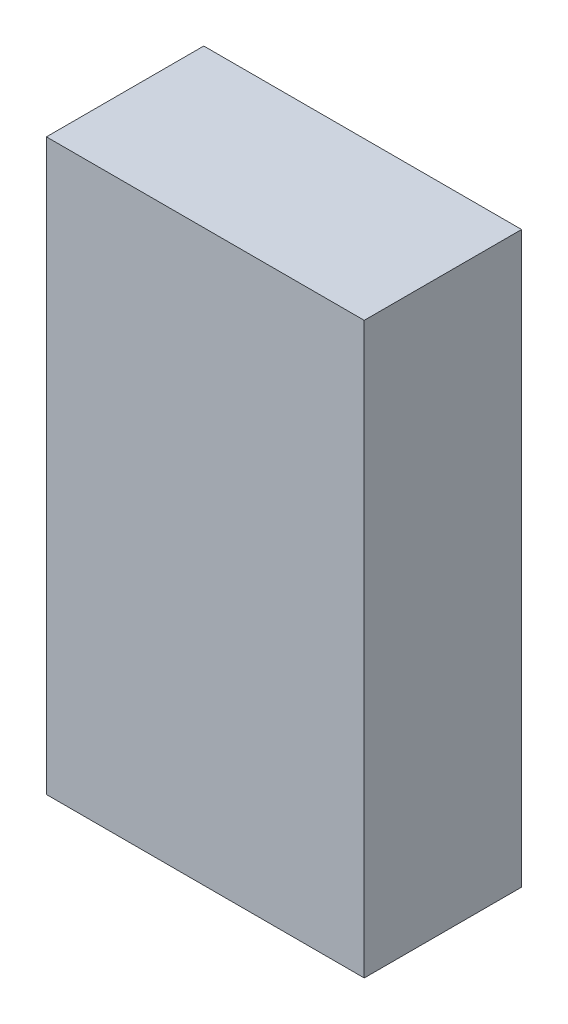
ISO-10303-21;
HEADER;
FILE_DESCRIPTION(('STEP AP214'),'2;1');
FILE_NAME('part.step','',(''),(''),'','','');
FILE_SCHEMA(('AUTOMOTIVE_DESIGN { 1 0 10303 214 1 1 1 1 }'));
ENDSEC;
DATA;
#1=APPLICATION_CONTEXT('core data for automotive mechanical design processes');
#2=APPLICATION_PROTOCOL_DEFINITION('international standard','automotive_design',2000,#1);
#3=PRODUCT_CONTEXT('',#1,'mechanical');
#4=PRODUCT('Part','Part','',(#3));
#5=PRODUCT_RELATED_PRODUCT_CATEGORY('part','',(#4));
#6=PRODUCT_DEFINITION_FORMATION('','',#4);
#7=PRODUCT_DEFINITION_CONTEXT('part definition',#1,'design');
#8=PRODUCT_DEFINITION('design','',#6,#7);
#9=PRODUCT_DEFINITION_SHAPE('','',#8);
#10=(LENGTH_UNIT() NAMED_UNIT(*) SI_UNIT(.MILLI.,.METRE.));
#11=(NAMED_UNIT(*) PLANE_ANGLE_UNIT() SI_UNIT($,.RADIAN.));
#12=(NAMED_UNIT(*) SI_UNIT($,.STERADIAN.) SOLID_ANGLE_UNIT());
#13=UNCERTAINTY_MEASURE_WITH_UNIT(LENGTH_MEASURE(1.E-05),#10,'distance_accuracy_value','');
#14=(GEOMETRIC_REPRESENTATION_CONTEXT(3) GLOBAL_UNCERTAINTY_ASSIGNED_CONTEXT((#13)) GLOBAL_UNIT_ASSIGNED_CONTEXT((#10,
#11,#12)) REPRESENTATION_CONTEXT('',''));
#15=CARTESIAN_POINT('',(0.,0.,0.));
#16=DIRECTION('',(0.,0.,1.));
#17=DIRECTION('',(1.,0.,0.));
#18=AXIS2_PLACEMENT_3D('',#15,#16,#17);
#19=CARTESIAN_POINT('',(0.50499772,-0.90499946,0.499999));
#20=DIRECTION('',(0.,0.,1.));
#21=DIRECTION('',(1.,0.,0.));
#22=AXIS2_PLACEMENT_3D('',#19,#20,#21);
#23=PLANE('',#22);
#24=DIRECTION('',(0.,-1.,0.));
#25=VECTOR('',#24,1.);
#26=CARTESIAN_POINT('',(0.50499772,0.90499946,0.499999));
#27=LINE('',#26,#25);
#28=CARTESIAN_POINT('',(0.50499772,0.90499946,0.499999));
#29=VERTEX_POINT('',#28);
#30=CARTESIAN_POINT('',(0.50499772,-0.90499946,0.499999));
#31=VERTEX_POINT('',#30);
#32=EDGE_CURVE('E27',#29,#31,#27,.T.);
#33=ORIENTED_EDGE('',*,*,#32,.F.);
#34=DIRECTION('',(1.,0.,0.));
#35=VECTOR('',#34,1.);
#36=CARTESIAN_POINT('',(-0.50499772,0.90499946,0.499999));
#37=LINE('',#36,#35);
#38=CARTESIAN_POINT('',(-0.50499772,0.90499946,0.499999));
#39=VERTEX_POINT('',#38);
#40=EDGE_CURVE('E104',#39,#29,#37,.T.);
#41=ORIENTED_EDGE('',*,*,#40,.F.);
#42=DIRECTION('',(0.,1.,0.));
#43=VECTOR('',#42,1.);
#44=CARTESIAN_POINT('',(-0.50499772,-0.90499946,0.499999));
#45=LINE('',#44,#43);
#46=CARTESIAN_POINT('',(-0.50499772,-0.90499946,0.499999));
#47=VERTEX_POINT('',#46);
#48=EDGE_CURVE('E80',#47,#39,#45,.T.);
#49=ORIENTED_EDGE('',*,*,#48,.F.);
#50=DIRECTION('',(-1.,0.,0.));
#51=VECTOR('',#50,1.);
#52=CARTESIAN_POINT('',(0.50499772,-0.90499946,0.499999));
#53=LINE('',#52,#51);
#54=EDGE_CURVE('E84',#31,#47,#53,.T.);
#55=ORIENTED_EDGE('',*,*,#54,.F.);
#56=EDGE_LOOP('',(#33,#41,#49,#55));
#57=FACE_BOUND('',#56,.T.);
#58=ADVANCED_FACE('F17',(#57),#23,.T.);
#59=CARTESIAN_POINT('',(0.50499772,-0.90499946,0.));
#60=DIRECTION('',(0.,0.,1.));
#61=DIRECTION('',(1.,0.,0.));
#62=AXIS2_PLACEMENT_3D('',#59,#60,#61);
#63=PLANE('',#62);
#64=DIRECTION('',(-1.,0.,0.));
#65=VECTOR('',#64,1.);
#66=CARTESIAN_POINT('',(0.50499772,-0.90499946,0.));
#67=LINE('',#66,#65);
#68=CARTESIAN_POINT('',(0.50499772,-0.90499946,0.));
#69=VERTEX_POINT('',#68);
#70=CARTESIAN_POINT('',(-0.50499772,-0.90499946,0.));
#71=VERTEX_POINT('',#70);
#72=EDGE_CURVE('E68',#69,#71,#67,.T.);
#73=ORIENTED_EDGE('',*,*,#72,.T.);
#74=DIRECTION('',(0.,1.,0.));
#75=VECTOR('',#74,1.);
#76=CARTESIAN_POINT('',(-0.50499772,-0.90499946,0.));
#77=LINE('',#76,#75);
#78=CARTESIAN_POINT('',(-0.50499772,0.90499946,0.));
#79=VERTEX_POINT('',#78);
#80=EDGE_CURVE('E93',#71,#79,#77,.T.);
#81=ORIENTED_EDGE('',*,*,#80,.T.);
#82=DIRECTION('',(1.,0.,0.));
#83=VECTOR('',#82,1.);
#84=CARTESIAN_POINT('',(-0.50499772,0.90499946,0.));
#85=LINE('',#84,#83);
#86=CARTESIAN_POINT('',(0.50499772,0.90499946,0.));
#87=VERTEX_POINT('',#86);
#88=EDGE_CURVE('E70',#79,#87,#85,.T.);
#89=ORIENTED_EDGE('',*,*,#88,.T.);
#90=DIRECTION('',(0.,-1.,0.));
#91=VECTOR('',#90,1.);
#92=CARTESIAN_POINT('',(0.50499772,0.90499946,0.));
#93=LINE('',#92,#91);
#94=EDGE_CURVE('E11',#87,#69,#93,.T.);
#95=ORIENTED_EDGE('',*,*,#94,.T.);
#96=EDGE_LOOP('',(#73,#81,#89,#95));
#97=FACE_BOUND('',#96,.T.);
#98=ADVANCED_FACE('F66',(#97),#63,.F.);
#99=CARTESIAN_POINT('',(0.50499772,0.90499946,0.));
#100=DIRECTION('',(1.,0.,0.));
#101=DIRECTION('',(0.,1.,0.));
#102=AXIS2_PLACEMENT_3D('',#99,#100,#101);
#103=PLANE('',#102);
#104=DIRECTION('',(0.,0.,1.));
#105=VECTOR('',#104,1.);
#106=CARTESIAN_POINT('',(0.50499772,0.90499946,0.));
#107=LINE('',#106,#105);
#108=EDGE_CURVE('E108',#87,#29,#107,.T.);
#109=ORIENTED_EDGE('',*,*,#108,.T.);
#110=ORIENTED_EDGE('',*,*,#32,.T.);
#111=DIRECTION('',(0.,0.,1.));
#112=VECTOR('',#111,1.);
#113=CARTESIAN_POINT('',(0.50499772,-0.90499946,0.));
#114=LINE('',#113,#112);
#115=EDGE_CURVE('E76',#69,#31,#114,.T.);
#116=ORIENTED_EDGE('',*,*,#115,.F.);
#117=ORIENTED_EDGE('',*,*,#94,.F.);
#118=EDGE_LOOP('',(#109,#110,#116,#117));
#119=FACE_BOUND('',#118,.T.);
#120=ADVANCED_FACE('F19',(#119),#103,.T.);
#121=CARTESIAN_POINT('',(-0.50499772,0.90499946,0.));
#122=DIRECTION('',(0.,1.,0.));
#123=DIRECTION('',(1.,0.,0.));
#124=AXIS2_PLACEMENT_3D('',#121,#122,#123);
#125=PLANE('',#124);
#126=DIRECTION('',(0.,0.,1.));
#127=VECTOR('',#126,1.);
#128=CARTESIAN_POINT('',(-0.50499772,0.90499946,0.));
#129=LINE('',#128,#127);
#130=EDGE_CURVE('E97',#79,#39,#129,.T.);
#131=ORIENTED_EDGE('',*,*,#130,.T.);
#132=ORIENTED_EDGE('',*,*,#40,.T.);
#133=ORIENTED_EDGE('',*,*,#108,.F.);
#134=ORIENTED_EDGE('',*,*,#88,.F.);
#135=EDGE_LOOP('',(#131,#132,#133,#134));
#136=FACE_BOUND('',#135,.T.);
#137=ADVANCED_FACE('F140',(#136),#125,.T.);
#138=CARTESIAN_POINT('',(-0.50499772,-0.90499946,0.));
#139=DIRECTION('',(-1.,0.,0.));
#140=DIRECTION('',(0.,0.,1.));
#141=AXIS2_PLACEMENT_3D('',#138,#139,#140);
#142=PLANE('',#141);
#143=DIRECTION('',(0.,0.,1.));
#144=VECTOR('',#143,1.);
#145=CARTESIAN_POINT('',(-0.50499772,-0.90499946,0.));
#146=LINE('',#145,#144);
#147=EDGE_CURVE('E78',#71,#47,#146,.T.);
#148=ORIENTED_EDGE('',*,*,#147,.T.);
#149=ORIENTED_EDGE('',*,*,#48,.T.);
#150=ORIENTED_EDGE('',*,*,#130,.F.);
#151=ORIENTED_EDGE('',*,*,#80,.F.);
#152=EDGE_LOOP('',(#148,#149,#150,#151));
#153=FACE_BOUND('',#152,.T.);
#154=ADVANCED_FACE('F129',(#153),#142,.T.);
#155=CARTESIAN_POINT('',(0.50499772,-0.90499946,0.));
#156=DIRECTION('',(0.,-1.,0.));
#157=DIRECTION('',(0.,0.,-1.));
#158=AXIS2_PLACEMENT_3D('',#155,#156,#157);
#159=PLANE('',#158);
#160=ORIENTED_EDGE('',*,*,#115,.T.);
#161=ORIENTED_EDGE('',*,*,#54,.T.);
#162=ORIENTED_EDGE('',*,*,#147,.F.);
#163=ORIENTED_EDGE('',*,*,#72,.F.);
#164=EDGE_LOOP('',(#160,#161,#162,#163));
#165=FACE_BOUND('',#164,.T.);
#166=ADVANCED_FACE('F74',(#165),#159,.T.);
#167=CLOSED_SHELL('',(#58,#98,#120,#137,#154,#166));
#168=MANIFOLD_SOLID_BREP('B1',#167);
#169=ADVANCED_BREP_SHAPE_REPRESENTATION('',(#18,#168),#14);
#170=SHAPE_DEFINITION_REPRESENTATION(#9,#169);
ENDSEC;
END-ISO-10303-21;
